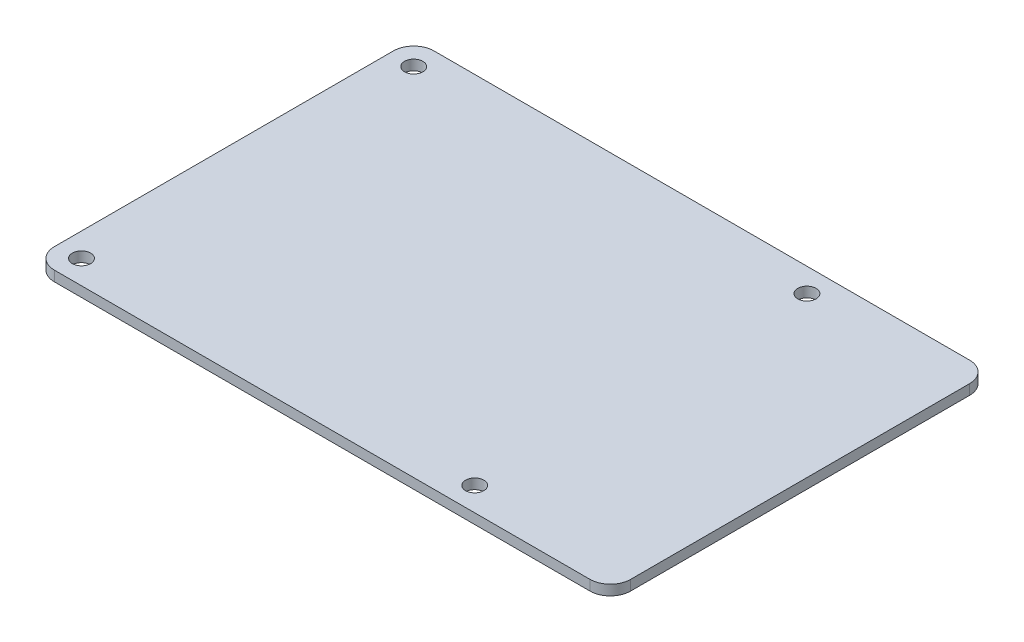
ISO-10303-21;
HEADER;
FILE_DESCRIPTION(('STEP AP214'),'2;1');
FILE_NAME('part.step','',(''),(''),'','','');
FILE_SCHEMA(('AUTOMOTIVE_DESIGN { 1 0 10303 214 1 1 1 1 }'));
ENDSEC;
DATA;
#1=APPLICATION_CONTEXT('core data for automotive mechanical design processes');
#2=APPLICATION_PROTOCOL_DEFINITION('international standard','automotive_design',2000,#1);
#3=PRODUCT_CONTEXT('',#1,'mechanical');
#4=PRODUCT('Part','Part','',(#3));
#5=PRODUCT_RELATED_PRODUCT_CATEGORY('part','',(#4));
#6=PRODUCT_DEFINITION_FORMATION('','',#4);
#7=PRODUCT_DEFINITION_CONTEXT('part definition',#1,'design');
#8=PRODUCT_DEFINITION('design','',#6,#7);
#9=PRODUCT_DEFINITION_SHAPE('','',#8);
#10=(LENGTH_UNIT() NAMED_UNIT(*) SI_UNIT(.MILLI.,.METRE.));
#11=(NAMED_UNIT(*) PLANE_ANGLE_UNIT() SI_UNIT($,.RADIAN.));
#12=(NAMED_UNIT(*) SI_UNIT($,.STERADIAN.) SOLID_ANGLE_UNIT());
#13=UNCERTAINTY_MEASURE_WITH_UNIT(LENGTH_MEASURE(1.E-05),#10,'distance_accuracy_value','');
#14=(GEOMETRIC_REPRESENTATION_CONTEXT(3) GLOBAL_UNCERTAINTY_ASSIGNED_CONTEXT((#13)) GLOBAL_UNIT_ASSIGNED_CONTEXT((#10,
#11,#12)) REPRESENTATION_CONTEXT('',''));
#15=CARTESIAN_POINT('',(0.,0.,0.));
#16=DIRECTION('',(0.,0.,1.));
#17=DIRECTION('',(1.,0.,0.));
#18=AXIS2_PLACEMENT_3D('',#15,#16,#17);
#19=CARTESIAN_POINT('',(0.,1.5,0.));
#20=DIRECTION('',(0.,1.,0.));
#21=DIRECTION('',(0.,0.,1.));
#22=AXIS2_PLACEMENT_3D('',#19,#20,#21);
#23=PLANE('',#22);
#24=CARTESIAN_POINT('',(-39.,1.5,-24.5));
#25=DIRECTION('',(0.,1.,0.));
#26=DIRECTION('',(0.,0.,1.));
#27=AXIS2_PLACEMENT_3D('',#24,#25,#26);
#28=CIRCLE('',#27,1.35);
#29=CARTESIAN_POINT('',(-39.,1.5,-23.15));
#30=VERTEX_POINT('',#29);
#31=EDGE_CURVE('E136',#30,#30,#28,.F.);
#32=ORIENTED_EDGE('',*,*,#31,.T.);
#33=EDGE_LOOP('',(#32));
#34=FACE_BOUND('',#33,.T.);
#35=CARTESIAN_POINT('',(19.,1.5,24.5));
#36=DIRECTION('',(0.,1.,0.));
#37=DIRECTION('',(0.,0.,1.));
#38=AXIS2_PLACEMENT_3D('',#35,#36,#37);
#39=CIRCLE('',#38,1.35);
#40=CARTESIAN_POINT('',(19.,1.5,25.85));
#41=VERTEX_POINT('',#40);
#42=EDGE_CURVE('E139',#41,#41,#39,.F.);
#43=ORIENTED_EDGE('',*,*,#42,.T.);
#44=EDGE_LOOP('',(#43));
#45=FACE_BOUND('',#44,.T.);
#46=CARTESIAN_POINT('',(-39.,1.5,24.5));
#47=DIRECTION('',(0.,1.,0.));
#48=DIRECTION('',(0.,0.,1.));
#49=AXIS2_PLACEMENT_3D('',#46,#47,#48);
#50=CIRCLE('',#49,1.35);
#51=CARTESIAN_POINT('',(-39.,1.5,25.85));
#52=VERTEX_POINT('',#51);
#53=EDGE_CURVE('E142',#52,#52,#50,.F.);
#54=ORIENTED_EDGE('',*,*,#53,.T.);
#55=EDGE_LOOP('',(#54));
#56=FACE_BOUND('',#55,.T.);
#57=CARTESIAN_POINT('',(19.,1.5,-24.5));
#58=DIRECTION('',(0.,1.,0.));
#59=DIRECTION('',(0.,0.,1.));
#60=AXIS2_PLACEMENT_3D('',#57,#58,#59);
#61=CIRCLE('',#60,1.35);
#62=CARTESIAN_POINT('',(19.,1.5,-23.15));
#63=VERTEX_POINT('',#62);
#64=EDGE_CURVE('E145',#63,#63,#61,.F.);
#65=ORIENTED_EDGE('',*,*,#64,.T.);
#66=EDGE_LOOP('',(#65));
#67=FACE_BOUND('',#66,.T.);
#68=DIRECTION('',(0.,0.,1.));
#69=VECTOR('',#68,1.);
#70=CARTESIAN_POINT('',(-42.5,1.5,-28.));
#71=LINE('',#70,#69);
#72=CARTESIAN_POINT('',(-42.5,1.5,25.));
#73=VERTEX_POINT('',#72);
#74=CARTESIAN_POINT('',(-42.5,1.5,-25.));
#75=VERTEX_POINT('',#74);
#76=EDGE_CURVE('E93',#73,#75,#71,.F.);
#77=ORIENTED_EDGE('',*,*,#76,.F.);
#78=CARTESIAN_POINT('',(-39.5,1.5,25.));
#79=DIRECTION('',(0.,-1.,0.));
#80=DIRECTION('',(0.,0.,-1.));
#81=AXIS2_PLACEMENT_3D('',#78,#79,#80);
#82=CIRCLE('',#81,3.);
#83=CARTESIAN_POINT('',(-39.5,1.5,28.));
#84=VERTEX_POINT('',#83);
#85=EDGE_CURVE('E20',#84,#73,#82,.T.);
#86=ORIENTED_EDGE('',*,*,#85,.F.);
#87=DIRECTION('',(1.,0.,0.));
#88=VECTOR('',#87,1.);
#89=CARTESIAN_POINT('',(-42.5,1.5,28.));
#90=LINE('',#89,#88);
#91=CARTESIAN_POINT('',(39.5,1.5,28.));
#92=VERTEX_POINT('',#91);
#93=EDGE_CURVE('E79',#92,#84,#90,.F.);
#94=ORIENTED_EDGE('',*,*,#93,.F.);
#95=CARTESIAN_POINT('',(39.5,1.5,25.));
#96=DIRECTION('',(0.,-1.,0.));
#97=DIRECTION('',(0.,0.,-1.));
#98=AXIS2_PLACEMENT_3D('',#95,#96,#97);
#99=CIRCLE('',#98,3.);
#100=CARTESIAN_POINT('',(42.5,1.5,25.));
#101=VERTEX_POINT('',#100);
#102=EDGE_CURVE('E100',#101,#92,#99,.T.);
#103=ORIENTED_EDGE('',*,*,#102,.F.);
#104=DIRECTION('',(0.,0.,-1.));
#105=VECTOR('',#104,1.);
#106=CARTESIAN_POINT('',(42.5,1.5,28.));
#107=LINE('',#106,#105);
#108=CARTESIAN_POINT('',(42.5,1.5,-25.));
#109=VERTEX_POINT('',#108);
#110=EDGE_CURVE('E111',#109,#101,#107,.F.);
#111=ORIENTED_EDGE('',*,*,#110,.F.);
#112=CARTESIAN_POINT('',(39.5,1.5,-25.));
#113=DIRECTION('',(0.,-1.,0.));
#114=DIRECTION('',(0.,0.,-1.));
#115=AXIS2_PLACEMENT_3D('',#112,#113,#114);
#116=CIRCLE('',#115,3.);
#117=CARTESIAN_POINT('',(39.5,1.5,-28.));
#118=VERTEX_POINT('',#117);
#119=EDGE_CURVE('E151',#118,#109,#116,.T.);
#120=ORIENTED_EDGE('',*,*,#119,.F.);
#121=DIRECTION('',(-1.,0.,0.));
#122=VECTOR('',#121,1.);
#123=CARTESIAN_POINT('',(42.5,1.5,-28.));
#124=LINE('',#123,#122);
#125=CARTESIAN_POINT('',(-39.5,1.5,-28.));
#126=VERTEX_POINT('',#125);
#127=EDGE_CURVE('E107',#126,#118,#124,.F.);
#128=ORIENTED_EDGE('',*,*,#127,.F.);
#129=CARTESIAN_POINT('',(-39.5,1.5,-25.));
#130=DIRECTION('',(0.,-1.,0.));
#131=DIRECTION('',(0.,0.,-1.));
#132=AXIS2_PLACEMENT_3D('',#129,#130,#131);
#133=CIRCLE('',#132,3.);
#134=EDGE_CURVE('E149',#75,#126,#133,.T.);
#135=ORIENTED_EDGE('',*,*,#134,.F.);
#136=EDGE_LOOP('',(#77,#86,#94,#103,#111,#120,#128,#135));
#137=FACE_BOUND('',#136,.T.);
#138=ADVANCED_FACE('F17',(#34,#45,#56,#67,#137),#23,.T.);
#139=CARTESIAN_POINT('',(-39.5,5.259,25.));
#140=DIRECTION('',(0.,-1.,0.));
#141=DIRECTION('',(0.,0.,-1.));
#142=AXIS2_PLACEMENT_3D('',#139,#140,#141);
#143=CYLINDRICAL_SURFACE('',#142,3.);
#144=DIRECTION('',(0.,1.,0.));
#145=VECTOR('',#144,1.);
#146=CARTESIAN_POINT('',(-42.5,0.,25.));
#147=LINE('',#146,#145);
#148=CARTESIAN_POINT('',(-42.5,0.,25.));
#149=VERTEX_POINT('',#148);
#150=EDGE_CURVE('E148',#149,#73,#147,.T.);
#151=ORIENTED_EDGE('',*,*,#150,.F.);
#152=CARTESIAN_POINT('',(-39.5,0.,25.));
#153=DIRECTION('',(0.,-1.,0.));
#154=DIRECTION('',(0.,0.,-1.));
#155=AXIS2_PLACEMENT_3D('',#152,#153,#154);
#156=CIRCLE('',#155,3.);
#157=CARTESIAN_POINT('',(-39.5,0.,28.));
#158=VERTEX_POINT('',#157);
#159=EDGE_CURVE('E99',#149,#158,#156,.F.);
#160=ORIENTED_EDGE('',*,*,#159,.T.);
#161=DIRECTION('',(0.,1.,0.));
#162=VECTOR('',#161,1.);
#163=CARTESIAN_POINT('',(-39.5,0.,28.));
#164=LINE('',#163,#162);
#165=EDGE_CURVE('E84',#84,#158,#164,.F.);
#166=ORIENTED_EDGE('',*,*,#165,.F.);
#167=ORIENTED_EDGE('',*,*,#85,.T.);
#168=EDGE_LOOP('',(#151,#160,#166,#167));
#169=FACE_BOUND('',#168,.T.);
#170=ADVANCED_FACE('F98',(#169),#143,.T.);
#171=CARTESIAN_POINT('',(-42.5,0.,28.));
#172=DIRECTION('',(0.,0.,1.));
#173=DIRECTION('',(1.,0.,0.));
#174=AXIS2_PLACEMENT_3D('',#171,#172,#173);
#175=PLANE('',#174);
#176=ORIENTED_EDGE('',*,*,#93,.T.);
#177=ORIENTED_EDGE('',*,*,#165,.T.);
#178=DIRECTION('',(1.,0.,0.));
#179=VECTOR('',#178,1.);
#180=CARTESIAN_POINT('',(0.,0.,28.));
#181=LINE('',#180,#179);
#182=CARTESIAN_POINT('',(39.5,0.,28.));
#183=VERTEX_POINT('',#182);
#184=EDGE_CURVE('E134',#158,#183,#181,.T.);
#185=ORIENTED_EDGE('',*,*,#184,.T.);
#186=DIRECTION('',(0.,-1.,0.));
#187=VECTOR('',#186,1.);
#188=CARTESIAN_POINT('',(39.5,5.259,28.));
#189=LINE('',#188,#187);
#190=EDGE_CURVE('E86',#92,#183,#189,.T.);
#191=ORIENTED_EDGE('',*,*,#190,.F.);
#192=EDGE_LOOP('',(#176,#177,#185,#191));
#193=FACE_BOUND('',#192,.T.);
#194=ADVANCED_FACE('F81',(#193),#175,.T.);
#195=CARTESIAN_POINT('',(39.5,5.259,25.));
#196=DIRECTION('',(0.,-1.,0.));
#197=DIRECTION('',(0.,0.,-1.));
#198=AXIS2_PLACEMENT_3D('',#195,#196,#197);
#199=CYLINDRICAL_SURFACE('',#198,3.);
#200=ORIENTED_EDGE('',*,*,#190,.T.);
#201=CARTESIAN_POINT('',(39.5,0.,25.));
#202=DIRECTION('',(0.,-1.,0.));
#203=DIRECTION('',(0.,0.,-1.));
#204=AXIS2_PLACEMENT_3D('',#201,#202,#203);
#205=CIRCLE('',#204,3.);
#206=CARTESIAN_POINT('',(42.5,0.,25.));
#207=VERTEX_POINT('',#206);
#208=EDGE_CURVE('E131',#183,#207,#205,.F.);
#209=ORIENTED_EDGE('',*,*,#208,.T.);
#210=DIRECTION('',(0.,1.,0.));
#211=VECTOR('',#210,1.);
#212=CARTESIAN_POINT('',(42.5,0.,25.));
#213=LINE('',#212,#211);
#214=EDGE_CURVE('E112',#101,#207,#213,.F.);
#215=ORIENTED_EDGE('',*,*,#214,.F.);
#216=ORIENTED_EDGE('',*,*,#102,.T.);
#217=EDGE_LOOP('',(#200,#209,#215,#216));
#218=FACE_BOUND('',#217,.T.);
#219=ADVANCED_FACE('F187',(#218),#199,.T.);
#220=CARTESIAN_POINT('',(42.5,0.,28.));
#221=DIRECTION('',(1.,0.,0.));
#222=DIRECTION('',(0.,0.,-1.));
#223=AXIS2_PLACEMENT_3D('',#220,#221,#222);
#224=PLANE('',#223);
#225=ORIENTED_EDGE('',*,*,#110,.T.);
#226=ORIENTED_EDGE('',*,*,#214,.T.);
#227=DIRECTION('',(0.,0.,1.));
#228=VECTOR('',#227,1.);
#229=CARTESIAN_POINT('',(42.5,0.,0.));
#230=LINE('',#229,#228);
#231=CARTESIAN_POINT('',(42.5,0.,-25.));
#232=VERTEX_POINT('',#231);
#233=EDGE_CURVE('E130',#207,#232,#230,.F.);
#234=ORIENTED_EDGE('',*,*,#233,.T.);
#235=DIRECTION('',(0.,-1.,0.));
#236=VECTOR('',#235,1.);
#237=CARTESIAN_POINT('',(42.5,5.259,-25.));
#238=LINE('',#237,#236);
#239=EDGE_CURVE('E110',#109,#232,#238,.T.);
#240=ORIENTED_EDGE('',*,*,#239,.F.);
#241=EDGE_LOOP('',(#225,#226,#234,#240));
#242=FACE_BOUND('',#241,.T.);
#243=ADVANCED_FACE('F184',(#242),#224,.T.);
#244=CARTESIAN_POINT('',(39.5,5.259,-25.));
#245=DIRECTION('',(0.,-1.,0.));
#246=DIRECTION('',(0.,0.,-1.));
#247=AXIS2_PLACEMENT_3D('',#244,#245,#246);
#248=CYLINDRICAL_SURFACE('',#247,3.);
#249=ORIENTED_EDGE('',*,*,#239,.T.);
#250=CARTESIAN_POINT('',(39.5,0.,-25.));
#251=DIRECTION('',(0.,-1.,0.));
#252=DIRECTION('',(0.,0.,-1.));
#253=AXIS2_PLACEMENT_3D('',#250,#251,#252);
#254=CIRCLE('',#253,3.);
#255=CARTESIAN_POINT('',(39.5,0.,-28.));
#256=VERTEX_POINT('',#255);
#257=EDGE_CURVE('E127',#232,#256,#254,.F.);
#258=ORIENTED_EDGE('',*,*,#257,.T.);
#259=DIRECTION('',(0.,1.,0.));
#260=VECTOR('',#259,1.);
#261=CARTESIAN_POINT('',(39.5,0.,-28.));
#262=LINE('',#261,#260);
#263=EDGE_CURVE('E109',#118,#256,#262,.F.);
#264=ORIENTED_EDGE('',*,*,#263,.F.);
#265=ORIENTED_EDGE('',*,*,#119,.T.);
#266=EDGE_LOOP('',(#249,#258,#264,#265));
#267=FACE_BOUND('',#266,.T.);
#268=ADVANCED_FACE('F182',(#267),#248,.T.);
#269=CARTESIAN_POINT('',(42.5,0.,-28.));
#270=DIRECTION('',(0.,0.,-1.));
#271=DIRECTION('',(-1.,0.,0.));
#272=AXIS2_PLACEMENT_3D('',#269,#270,#271);
#273=PLANE('',#272);
#274=DIRECTION('',(1.,0.,0.));
#275=VECTOR('',#274,1.);
#276=CARTESIAN_POINT('',(0.,0.,-28.));
#277=LINE('',#276,#275);
#278=CARTESIAN_POINT('',(-39.5,0.,-28.));
#279=VERTEX_POINT('',#278);
#280=EDGE_CURVE('E126',#256,#279,#277,.F.);
#281=ORIENTED_EDGE('',*,*,#280,.T.);
#282=DIRECTION('',(0.,-1.,0.));
#283=VECTOR('',#282,1.);
#284=CARTESIAN_POINT('',(-39.5,5.259,-28.));
#285=LINE('',#284,#283);
#286=EDGE_CURVE('E106',#126,#279,#285,.T.);
#287=ORIENTED_EDGE('',*,*,#286,.F.);
#288=ORIENTED_EDGE('',*,*,#127,.T.);
#289=ORIENTED_EDGE('',*,*,#263,.T.);
#290=EDGE_LOOP('',(#281,#287,#288,#289));
#291=FACE_BOUND('',#290,.T.);
#292=ADVANCED_FACE('F180',(#291),#273,.T.);
#293=CARTESIAN_POINT('',(-39.5,5.259,-25.));
#294=DIRECTION('',(0.,-1.,0.));
#295=DIRECTION('',(0.,0.,-1.));
#296=AXIS2_PLACEMENT_3D('',#293,#294,#295);
#297=CYLINDRICAL_SURFACE('',#296,3.);
#298=ORIENTED_EDGE('',*,*,#286,.T.);
#299=CARTESIAN_POINT('',(-39.5,0.,-25.));
#300=DIRECTION('',(0.,-1.,0.));
#301=DIRECTION('',(0.,0.,-1.));
#302=AXIS2_PLACEMENT_3D('',#299,#300,#301);
#303=CIRCLE('',#302,3.);
#304=CARTESIAN_POINT('',(-42.5,0.,-25.));
#305=VERTEX_POINT('',#304);
#306=EDGE_CURVE('E123',#279,#305,#303,.F.);
#307=ORIENTED_EDGE('',*,*,#306,.T.);
#308=DIRECTION('',(0.,1.,0.));
#309=VECTOR('',#308,1.);
#310=CARTESIAN_POINT('',(-42.5,0.,-25.));
#311=LINE('',#310,#309);
#312=EDGE_CURVE('E35',#75,#305,#311,.F.);
#313=ORIENTED_EDGE('',*,*,#312,.F.);
#314=ORIENTED_EDGE('',*,*,#134,.T.);
#315=EDGE_LOOP('',(#298,#307,#313,#314));
#316=FACE_BOUND('',#315,.T.);
#317=ADVANCED_FACE('F176',(#316),#297,.T.);
#318=CARTESIAN_POINT('',(-42.5,0.,-28.));
#319=DIRECTION('',(-1.,0.,0.));
#320=DIRECTION('',(0.,0.,1.));
#321=AXIS2_PLACEMENT_3D('',#318,#319,#320);
#322=PLANE('',#321);
#323=DIRECTION('',(0.,0.,1.));
#324=VECTOR('',#323,1.);
#325=CARTESIAN_POINT('',(-42.5,0.,0.));
#326=LINE('',#325,#324);
#327=EDGE_CURVE('E122',#305,#149,#326,.T.);
#328=ORIENTED_EDGE('',*,*,#327,.T.);
#329=ORIENTED_EDGE('',*,*,#150,.T.);
#330=ORIENTED_EDGE('',*,*,#76,.T.);
#331=ORIENTED_EDGE('',*,*,#312,.T.);
#332=EDGE_LOOP('',(#328,#329,#330,#331));
#333=FACE_BOUND('',#332,.T.);
#334=ADVANCED_FACE('F170',(#333),#322,.T.);
#335=CARTESIAN_POINT('',(19.,-11.225,-24.5));
#336=DIRECTION('',(0.,1.,0.));
#337=DIRECTION('',(0.,0.,1.));
#338=AXIS2_PLACEMENT_3D('',#335,#336,#337);
#339=CYLINDRICAL_SURFACE('',#338,1.35);
#340=ORIENTED_EDGE('',*,*,#64,.F.);
#341=EDGE_LOOP('',(#340));
#342=FACE_BOUND('',#341,.T.);
#343=CARTESIAN_POINT('',(19.,0.,-24.5));
#344=DIRECTION('',(0.,1.,0.));
#345=DIRECTION('',(0.,0.,1.));
#346=AXIS2_PLACEMENT_3D('',#343,#344,#345);
#347=CIRCLE('',#346,1.35);
#348=CARTESIAN_POINT('',(19.,0.,-23.15));
#349=VERTEX_POINT('',#348);
#350=EDGE_CURVE('E119',#349,#349,#347,.F.);
#351=ORIENTED_EDGE('',*,*,#350,.T.);
#352=EDGE_LOOP('',(#351));
#353=FACE_BOUND('',#352,.T.);
#354=ADVANCED_FACE('F216',(#342,#353),#339,.F.);
#355=CARTESIAN_POINT('',(-39.,-11.225,24.5));
#356=DIRECTION('',(0.,1.,0.));
#357=DIRECTION('',(0.,0.,1.));
#358=AXIS2_PLACEMENT_3D('',#355,#356,#357);
#359=CYLINDRICAL_SURFACE('',#358,1.35);
#360=ORIENTED_EDGE('',*,*,#53,.F.);
#361=EDGE_LOOP('',(#360));
#362=FACE_BOUND('',#361,.T.);
#363=CARTESIAN_POINT('',(-39.,0.,24.5));
#364=DIRECTION('',(0.,1.,0.));
#365=DIRECTION('',(0.,0.,1.));
#366=AXIS2_PLACEMENT_3D('',#363,#364,#365);
#367=CIRCLE('',#366,1.35);
#368=CARTESIAN_POINT('',(-39.,0.,25.85));
#369=VERTEX_POINT('',#368);
#370=EDGE_CURVE('E116',#369,#369,#367,.F.);
#371=ORIENTED_EDGE('',*,*,#370,.T.);
#372=EDGE_LOOP('',(#371));
#373=FACE_BOUND('',#372,.T.);
#374=ADVANCED_FACE('F212',(#362,#373),#359,.F.);
#375=CARTESIAN_POINT('',(19.,-11.225,24.5));
#376=DIRECTION('',(0.,1.,0.));
#377=DIRECTION('',(0.,0.,1.));
#378=AXIS2_PLACEMENT_3D('',#375,#376,#377);
#379=CYLINDRICAL_SURFACE('',#378,1.35);
#380=ORIENTED_EDGE('',*,*,#42,.F.);
#381=EDGE_LOOP('',(#380));
#382=FACE_BOUND('',#381,.T.);
#383=CARTESIAN_POINT('',(19.,0.,24.5));
#384=DIRECTION('',(0.,1.,0.));
#385=DIRECTION('',(0.,0.,1.));
#386=AXIS2_PLACEMENT_3D('',#383,#384,#385);
#387=CIRCLE('',#386,1.35);
#388=CARTESIAN_POINT('',(19.,0.,25.85));
#389=VERTEX_POINT('',#388);
#390=EDGE_CURVE('E26',#389,#389,#387,.F.);
#391=ORIENTED_EDGE('',*,*,#390,.T.);
#392=EDGE_LOOP('',(#391));
#393=FACE_BOUND('',#392,.T.);
#394=ADVANCED_FACE('F204',(#382,#393),#379,.F.);
#395=CARTESIAN_POINT('',(-39.,-11.225,-24.5));
#396=DIRECTION('',(0.,1.,0.));
#397=DIRECTION('',(0.,0.,1.));
#398=AXIS2_PLACEMENT_3D('',#395,#396,#397);
#399=CYLINDRICAL_SURFACE('',#398,1.35);
#400=ORIENTED_EDGE('',*,*,#31,.F.);
#401=EDGE_LOOP('',(#400));
#402=FACE_BOUND('',#401,.T.);
#403=CARTESIAN_POINT('',(-39.,0.,-24.5));
#404=DIRECTION('',(0.,1.,0.));
#405=DIRECTION('',(0.,0.,1.));
#406=AXIS2_PLACEMENT_3D('',#403,#404,#405);
#407=CIRCLE('',#406,1.35);
#408=CARTESIAN_POINT('',(-39.,0.,-23.15));
#409=VERTEX_POINT('',#408);
#410=EDGE_CURVE('E11',#409,#409,#407,.F.);
#411=ORIENTED_EDGE('',*,*,#410,.T.);
#412=EDGE_LOOP('',(#411));
#413=FACE_BOUND('',#412,.T.);
#414=ADVANCED_FACE('F198',(#402,#413),#399,.F.);
#415=CARTESIAN_POINT('',(0.,0.,0.));
#416=DIRECTION('',(0.,1.,0.));
#417=DIRECTION('',(0.,0.,1.));
#418=AXIS2_PLACEMENT_3D('',#415,#416,#417);
#419=PLANE('',#418);
#420=ORIENTED_EDGE('',*,*,#410,.F.);
#421=EDGE_LOOP('',(#420));
#422=FACE_BOUND('',#421,.T.);
#423=ORIENTED_EDGE('',*,*,#390,.F.);
#424=EDGE_LOOP('',(#423));
#425=FACE_BOUND('',#424,.T.);
#426=ORIENTED_EDGE('',*,*,#370,.F.);
#427=EDGE_LOOP('',(#426));
#428=FACE_BOUND('',#427,.T.);
#429=ORIENTED_EDGE('',*,*,#350,.F.);
#430=EDGE_LOOP('',(#429));
#431=FACE_BOUND('',#430,.T.);
#432=ORIENTED_EDGE('',*,*,#306,.F.);
#433=ORIENTED_EDGE('',*,*,#280,.F.);
#434=ORIENTED_EDGE('',*,*,#257,.F.);
#435=ORIENTED_EDGE('',*,*,#233,.F.);
#436=ORIENTED_EDGE('',*,*,#208,.F.);
#437=ORIENTED_EDGE('',*,*,#184,.F.);
#438=ORIENTED_EDGE('',*,*,#159,.F.);
#439=ORIENTED_EDGE('',*,*,#327,.F.);
#440=EDGE_LOOP('',(#432,#433,#434,#435,#436,#437,#438,#439));
#441=FACE_BOUND('',#440,.T.);
#442=ADVANCED_FACE('F173',(#422,#425,#428,#431,#441),#419,.F.);
#443=CLOSED_SHELL('',(#138,#170,#194,#219,#243,#268,#292,#317,#334,#354,#374,#394,#414,#442));
#444=MANIFOLD_SOLID_BREP('B1',#443);
#445=ADVANCED_BREP_SHAPE_REPRESENTATION('',(#18,#444),#14);
#446=SHAPE_DEFINITION_REPRESENTATION(#9,#445);
ENDSEC;
END-ISO-10303-21;
